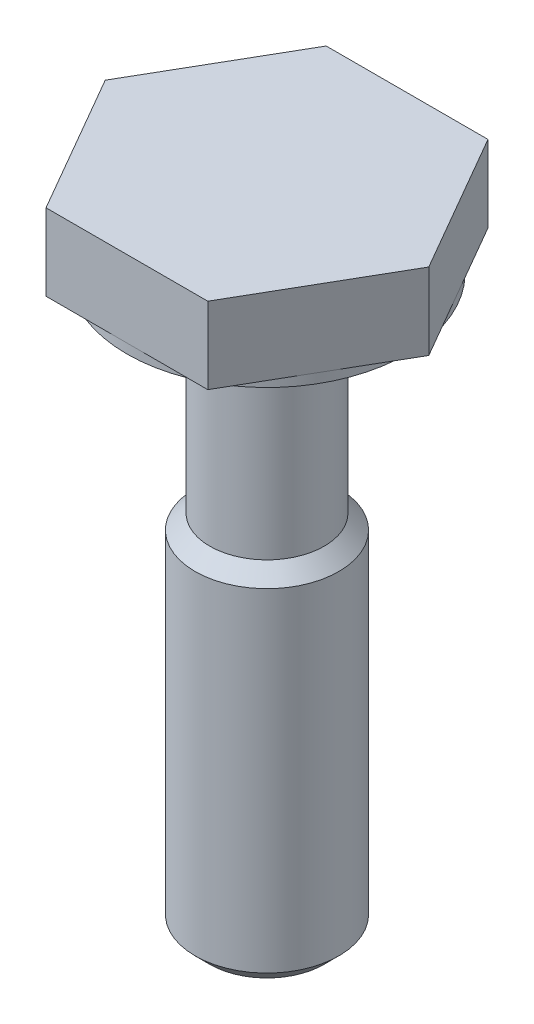
ISO-10303-21;
HEADER;
FILE_DESCRIPTION(('STEP AP214'),'2;1');
FILE_NAME('part.step','',(''),(''),'','','');
FILE_SCHEMA(('AUTOMOTIVE_DESIGN { 1 0 10303 214 1 1 1 1 }'));
ENDSEC;
DATA;
#1=APPLICATION_CONTEXT('core data for automotive mechanical design processes');
#2=APPLICATION_PROTOCOL_DEFINITION('international standard','automotive_design',2000,#1);
#3=PRODUCT_CONTEXT('',#1,'mechanical');
#4=PRODUCT('Part','Part','',(#3));
#5=PRODUCT_RELATED_PRODUCT_CATEGORY('part','',(#4));
#6=PRODUCT_DEFINITION_FORMATION('','',#4);
#7=PRODUCT_DEFINITION_CONTEXT('part definition',#1,'design');
#8=PRODUCT_DEFINITION('design','',#6,#7);
#9=PRODUCT_DEFINITION_SHAPE('','',#8);
#10=(LENGTH_UNIT() NAMED_UNIT(*) SI_UNIT(.MILLI.,.METRE.));
#11=(NAMED_UNIT(*) PLANE_ANGLE_UNIT() SI_UNIT($,.RADIAN.));
#12=(NAMED_UNIT(*) SI_UNIT($,.STERADIAN.) SOLID_ANGLE_UNIT());
#13=UNCERTAINTY_MEASURE_WITH_UNIT(LENGTH_MEASURE(1.E-05),#10,'distance_accuracy_value','');
#14=(GEOMETRIC_REPRESENTATION_CONTEXT(3) GLOBAL_UNCERTAINTY_ASSIGNED_CONTEXT((#13)) GLOBAL_UNIT_ASSIGNED_CONTEXT((#10,
#11,#12)) REPRESENTATION_CONTEXT('',''));
#15=CARTESIAN_POINT('',(0.,0.,0.));
#16=DIRECTION('',(0.,0.,1.));
#17=DIRECTION('',(1.,0.,0.));
#18=AXIS2_PLACEMENT_3D('',#15,#16,#17);
#19=CARTESIAN_POINT('',(0.,0.,0.));
#20=DIRECTION('',(0.,1.,0.));
#21=DIRECTION('',(0.,0.,1.));
#22=AXIS2_PLACEMENT_3D('',#19,#20,#21);
#23=CYLINDRICAL_SURFACE('',#22,1.195);
#24=CARTESIAN_POINT('',(0.,-4.34,0.));
#25=DIRECTION('',(0.,1.,0.));
#26=DIRECTION('',(0.,0.,1.));
#27=AXIS2_PLACEMENT_3D('',#24,#25,#26);
#28=CIRCLE('',#27,1.195);
#29=CARTESIAN_POINT('',(0.,-4.34,1.195));
#30=VERTEX_POINT('',#29);
#31=EDGE_CURVE('E196',#30,#30,#28,.T.);
#32=ORIENTED_EDGE('',*,*,#31,.T.);
#33=EDGE_LOOP('',(#32));
#34=FACE_BOUND('',#33,.T.);
#35=CARTESIAN_POINT('',(0.,0.199999999999999,0.));
#36=DIRECTION('',(0.,1.,0.));
#37=DIRECTION('',(0.,0.,1.));
#38=AXIS2_PLACEMENT_3D('',#35,#36,#37);
#39=CIRCLE('',#38,1.195);
#40=CARTESIAN_POINT('',(0.,0.199999999999999,1.195));
#41=VERTEX_POINT('',#40);
#42=EDGE_CURVE('E40',#41,#41,#39,.F.);
#43=ORIENTED_EDGE('',*,*,#42,.T.);
#44=EDGE_LOOP('',(#43));
#45=FACE_BOUND('',#44,.T.);
#46=ADVANCED_FACE('F36',(#34,#45),#23,.T.);
#47=CARTESIAN_POINT('',(0.,-4.34,0.));
#48=DIRECTION('',(0.,-1.,0.));
#49=DIRECTION('',(0.,0.,-1.));
#50=AXIS2_PLACEMENT_3D('',#47,#48,#49);
#51=CONICAL_SURFACE('',#50,1.195,0.785398163397453);
#52=CARTESIAN_POINT('',(0.,-4.645,0.));
#53=DIRECTION('',(0.,1.,0.));
#54=DIRECTION('',(0.,0.,1.));
#55=AXIS2_PLACEMENT_3D('',#52,#53,#54);
#56=CIRCLE('',#55,1.5);
#57=CARTESIAN_POINT('',(0.,-4.645,1.5));
#58=VERTEX_POINT('',#57);
#59=EDGE_CURVE('E193',#58,#58,#56,.T.);
#60=ORIENTED_EDGE('',*,*,#59,.T.);
#61=EDGE_LOOP('',(#60));
#62=FACE_BOUND('',#61,.T.);
#63=ORIENTED_EDGE('',*,*,#31,.F.);
#64=EDGE_LOOP('',(#63));
#65=FACE_BOUND('',#64,.T.);
#66=ADVANCED_FACE('F222',(#62,#65),#51,.T.);
#67=CARTESIAN_POINT('',(0.,0.,0.));
#68=DIRECTION('',(0.,1.,0.));
#69=DIRECTION('',(0.,0.,1.));
#70=AXIS2_PLACEMENT_3D('',#67,#68,#69);
#71=CYLINDRICAL_SURFACE('',#70,1.5);
#72=CARTESIAN_POINT('',(0.,-11.595,0.));
#73=DIRECTION('',(0.,1.,0.));
#74=DIRECTION('',(0.,0.,1.));
#75=AXIS2_PLACEMENT_3D('',#72,#73,#74);
#76=CIRCLE('',#75,1.5);
#77=CARTESIAN_POINT('',(0.,-11.595,1.5));
#78=VERTEX_POINT('',#77);
#79=EDGE_CURVE('E190',#78,#78,#76,.T.);
#80=ORIENTED_EDGE('',*,*,#79,.T.);
#81=EDGE_LOOP('',(#80));
#82=FACE_BOUND('',#81,.T.);
#83=ORIENTED_EDGE('',*,*,#59,.F.);
#84=EDGE_LOOP('',(#83));
#85=FACE_BOUND('',#84,.T.);
#86=ADVANCED_FACE('F228',(#82,#85),#71,.T.);
#87=CARTESIAN_POINT('',(0.,-11.595,0.));
#88=DIRECTION('',(0.,1.,0.));
#89=DIRECTION('',(0.,0.,1.));
#90=AXIS2_PLACEMENT_3D('',#87,#88,#89);
#91=CONICAL_SURFACE('',#90,1.5,0.785398163397445);
#92=CARTESIAN_POINT('',(0.,-11.9,0.));
#93=DIRECTION('',(0.,1.,0.));
#94=DIRECTION('',(0.,0.,1.));
#95=AXIS2_PLACEMENT_3D('',#92,#93,#94);
#96=CIRCLE('',#95,1.195);
#97=CARTESIAN_POINT('',(0.,-11.9,1.195));
#98=VERTEX_POINT('',#97);
#99=EDGE_CURVE('E187',#98,#98,#96,.T.);
#100=ORIENTED_EDGE('',*,*,#99,.T.);
#101=EDGE_LOOP('',(#100));
#102=FACE_BOUND('',#101,.T.);
#103=ORIENTED_EDGE('',*,*,#79,.F.);
#104=EDGE_LOOP('',(#103));
#105=FACE_BOUND('',#104,.T.);
#106=ADVANCED_FACE('F296',(#102,#105),#91,.T.);
#107=CARTESIAN_POINT('',(-1.195,-11.9,0.));
#108=DIRECTION('',(0.,-1.,0.));
#109=DIRECTION('',(0.,0.,-1.));
#110=AXIS2_PLACEMENT_3D('',#107,#108,#109);
#111=PLANE('',#110);
#112=CARTESIAN_POINT('',(0.,-11.9,0.));
#113=DIRECTION('',(0.,1.,0.));
#114=DIRECTION('',(0.,0.,1.));
#115=AXIS2_PLACEMENT_3D('',#112,#113,#114);
#116=CIRCLE('',#115,0.649999999999999);
#117=CARTESIAN_POINT('',(0.,-11.9,0.649999999999999));
#118=VERTEX_POINT('',#117);
#119=EDGE_CURVE('E184',#118,#118,#116,.T.);
#120=ORIENTED_EDGE('',*,*,#119,.T.);
#121=EDGE_LOOP('',(#120));
#122=FACE_BOUND('',#121,.T.);
#123=ORIENTED_EDGE('',*,*,#99,.F.);
#124=EDGE_LOOP('',(#123));
#125=FACE_BOUND('',#124,.T.);
#126=ADVANCED_FACE('F293',(#122,#125),#111,.T.);
#127=CARTESIAN_POINT('',(0.,-11.9,0.));
#128=DIRECTION('',(0.,-1.,0.));
#129=DIRECTION('',(0.,0.,-1.));
#130=AXIS2_PLACEMENT_3D('',#127,#128,#129);
#131=CONICAL_SURFACE('',#130,0.649999999999999,0.777764723879954);
#132=CARTESIAN_POINT('',(0.,-11.24,0.));
#133=VERTEX_POINT('',#132);
#134=VERTEX_LOOP('',#133);
#135=FACE_BOUND('',#134,.T.);
#136=ORIENTED_EDGE('',*,*,#119,.F.);
#137=EDGE_LOOP('',(#136));
#138=FACE_BOUND('',#137,.T.);
#139=ADVANCED_FACE('F215',(#135,#138),#131,.F.);
#140=CARTESIAN_POINT('',(0.,0.199999999999999,0.));
#141=DIRECTION('',(0.,1.,0.));
#142=DIRECTION('',(0.,0.,1.));
#143=AXIS2_PLACEMENT_3D('',#140,#141,#142);
#144=PLANE('',#143);
#145=CARTESIAN_POINT('',(0.,0.199999999999999,0.));
#146=DIRECTION('',(0.,1.,0.));
#147=DIRECTION('',(0.,0.,1.));
#148=AXIS2_PLACEMENT_3D('',#145,#146,#147);
#149=CIRCLE('',#148,2.5);
#150=CARTESIAN_POINT('',(0.,0.199999999999999,2.5));
#151=VERTEX_POINT('',#150);
#152=EDGE_CURVE('E176',#151,#151,#149,.T.);
#153=ORIENTED_EDGE('',*,*,#152,.F.);
#154=EDGE_LOOP('',(#153));
#155=FACE_BOUND('',#154,.T.);
#156=ORIENTED_EDGE('',*,*,#42,.F.);
#157=EDGE_LOOP('',(#156));
#158=FACE_BOUND('',#157,.T.);
#159=ADVANCED_FACE('F212',(#155,#158),#144,.F.);
#160=CARTESIAN_POINT('',(0.,0.,0.));
#161=DIRECTION('',(0.,1.,0.));
#162=DIRECTION('',(0.,0.,1.));
#163=AXIS2_PLACEMENT_3D('',#160,#161,#162);
#164=CYLINDRICAL_SURFACE('',#163,2.925);
#165=CARTESIAN_POINT('',(0.,0.,0.));
#166=DIRECTION('',(0.,1.,0.));
#167=DIRECTION('',(0.,0.,1.));
#168=AXIS2_PLACEMENT_3D('',#165,#166,#167);
#169=CIRCLE('',#168,2.925);
#170=CARTESIAN_POINT('',(0.,0.,2.925));
#171=VERTEX_POINT('',#170);
#172=EDGE_CURVE('E11',#171,#171,#169,.T.);
#173=ORIENTED_EDGE('',*,*,#172,.T.);
#174=EDGE_LOOP('',(#173));
#175=FACE_BOUND('',#174,.T.);
#176=CARTESIAN_POINT('',(0.,0.199999999999999,0.));
#177=DIRECTION('',(0.,1.,0.));
#178=DIRECTION('',(0.,0.,1.));
#179=AXIS2_PLACEMENT_3D('',#176,#177,#178);
#180=CIRCLE('',#179,2.925);
#181=CARTESIAN_POINT('',(2.53312430606948,0.199999999999999,1.4625));
#182=VERTEX_POINT('',#181);
#183=CARTESIAN_POINT('',(0.,0.199999999999999,2.925));
#184=VERTEX_POINT('',#183);
#185=EDGE_CURVE('E179',#182,#184,#180,.F.);
#186=ORIENTED_EDGE('',*,*,#185,.T.);
#187=CARTESIAN_POINT('',(-2.53312430606948,0.199999999999999,1.4625));
#188=VERTEX_POINT('',#187);
#189=EDGE_CURVE('E183',#184,#188,#180,.F.);
#190=ORIENTED_EDGE('',*,*,#189,.T.);
#191=CARTESIAN_POINT('',(-2.53312430606948,0.199999999999999,-1.4625));
#192=VERTEX_POINT('',#191);
#193=EDGE_CURVE('E266',#188,#192,#180,.F.);
#194=ORIENTED_EDGE('',*,*,#193,.T.);
#195=CARTESIAN_POINT('',(0.,0.199999999999999,-2.925));
#196=VERTEX_POINT('',#195);
#197=EDGE_CURVE('E267',#192,#196,#180,.F.);
#198=ORIENTED_EDGE('',*,*,#197,.T.);
#199=CARTESIAN_POINT('',(2.53312430606948,0.199999999999999,-1.4625));
#200=VERTEX_POINT('',#199);
#201=EDGE_CURVE('E135',#196,#200,#180,.F.);
#202=ORIENTED_EDGE('',*,*,#201,.T.);
#203=EDGE_CURVE('E182',#200,#182,#180,.F.);
#204=ORIENTED_EDGE('',*,*,#203,.T.);
#205=EDGE_LOOP('',(#186,#190,#194,#198,#202,#204));
#206=FACE_BOUND('',#205,.T.);
#207=ADVANCED_FACE('F38',(#175,#206),#164,.T.);
#208=CARTESIAN_POINT('',(-2.925,0.,0.));
#209=DIRECTION('',(0.,-1.,0.));
#210=DIRECTION('',(0.,0.,-1.));
#211=AXIS2_PLACEMENT_3D('',#208,#209,#210);
#212=PLANE('',#211);
#213=CARTESIAN_POINT('',(0.,0.,0.));
#214=DIRECTION('',(0.,1.,0.));
#215=DIRECTION('',(0.,0.,1.));
#216=AXIS2_PLACEMENT_3D('',#213,#214,#215);
#217=CIRCLE('',#216,2.5);
#218=CARTESIAN_POINT('',(0.,0.,2.5));
#219=VERTEX_POINT('',#218);
#220=EDGE_CURVE('E45',#219,#219,#217,.T.);
#221=ORIENTED_EDGE('',*,*,#220,.T.);
#222=EDGE_LOOP('',(#221));
#223=FACE_BOUND('',#222,.T.);
#224=ORIENTED_EDGE('',*,*,#172,.F.);
#225=EDGE_LOOP('',(#224));
#226=FACE_BOUND('',#225,.T.);
#227=ADVANCED_FACE('F202',(#223,#226),#212,.T.);
#228=CARTESIAN_POINT('',(0.,0.,0.));
#229=DIRECTION('',(0.,1.,0.));
#230=DIRECTION('',(0.,0.,1.));
#231=AXIS2_PLACEMENT_3D('',#228,#229,#230);
#232=CYLINDRICAL_SURFACE('',#231,2.5);
#233=ORIENTED_EDGE('',*,*,#220,.F.);
#234=EDGE_LOOP('',(#233));
#235=FACE_BOUND('',#234,.T.);
#236=ORIENTED_EDGE('',*,*,#152,.T.);
#237=EDGE_LOOP('',(#236));
#238=FACE_BOUND('',#237,.T.);
#239=ADVANCED_FACE('F205',(#235,#238),#232,.F.);
#240=ORIENTED_EDGE('',*,*,#189,.F.);
#241=DIRECTION('',(1.,0.,0.));
#242=VECTOR('',#241,1.);
#243=CARTESIAN_POINT('',(-1.68874953737965,0.199999999999999,2.925));
#244=LINE('',#243,#242);
#245=CARTESIAN_POINT('',(-1.68874953737965,0.199999999999999,2.925));
#246=VERTEX_POINT('',#245);
#247=EDGE_CURVE('E52',#246,#184,#244,.T.);
#248=ORIENTED_EDGE('',*,*,#247,.F.);
#249=DIRECTION('',(0.5,0.,0.866025403784439));
#250=VECTOR('',#249,1.);
#251=CARTESIAN_POINT('',(-3.37749907475931,0.199999999999999,0.));
#252=LINE('',#251,#250);
#253=EDGE_CURVE('E144',#188,#246,#252,.T.);
#254=ORIENTED_EDGE('',*,*,#253,.F.);
#255=EDGE_LOOP('',(#240,#248,#254));
#256=FACE_BOUND('',#255,.T.);
#257=ADVANCED_FACE('F208',(#256),#144,.F.);
#258=ORIENTED_EDGE('',*,*,#193,.F.);
#259=CARTESIAN_POINT('',(-3.37749907475931,0.199999999999999,0.));
#260=VERTEX_POINT('',#259);
#261=EDGE_CURVE('E145',#260,#188,#252,.T.);
#262=ORIENTED_EDGE('',*,*,#261,.F.);
#263=DIRECTION('',(-0.5,0.,0.866025403784439));
#264=VECTOR('',#263,1.);
#265=CARTESIAN_POINT('',(-1.68874953737966,0.199999999999999,-2.925));
#266=LINE('',#265,#264);
#267=EDGE_CURVE('E137',#192,#260,#266,.T.);
#268=ORIENTED_EDGE('',*,*,#267,.F.);
#269=EDGE_LOOP('',(#258,#262,#268));
#270=FACE_BOUND('',#269,.T.);
#271=ADVANCED_FACE('F273',(#270),#144,.F.);
#272=ORIENTED_EDGE('',*,*,#197,.F.);
#273=CARTESIAN_POINT('',(-1.68874953737966,0.199999999999999,-2.925));
#274=VERTEX_POINT('',#273);
#275=EDGE_CURVE('E140',#274,#192,#266,.T.);
#276=ORIENTED_EDGE('',*,*,#275,.F.);
#277=DIRECTION('',(-1.,0.,0.));
#278=VECTOR('',#277,1.);
#279=CARTESIAN_POINT('',(1.68874953737965,0.199999999999999,-2.925));
#280=LINE('',#279,#278);
#281=EDGE_CURVE('E138',#196,#274,#280,.T.);
#282=ORIENTED_EDGE('',*,*,#281,.F.);
#283=EDGE_LOOP('',(#272,#276,#282));
#284=FACE_BOUND('',#283,.T.);
#285=ADVANCED_FACE('F271',(#284),#144,.F.);
#286=ORIENTED_EDGE('',*,*,#201,.F.);
#287=CARTESIAN_POINT('',(1.68874953737965,0.199999999999999,-2.925));
#288=VERTEX_POINT('',#287);
#289=EDGE_CURVE('E126',#288,#196,#280,.T.);
#290=ORIENTED_EDGE('',*,*,#289,.F.);
#291=DIRECTION('',(-0.5,0.,-0.866025403784439));
#292=VECTOR('',#291,1.);
#293=CARTESIAN_POINT('',(3.37749907475931,0.199999999999999,0.));
#294=LINE('',#293,#292);
#295=EDGE_CURVE('E109',#200,#288,#294,.T.);
#296=ORIENTED_EDGE('',*,*,#295,.F.);
#297=EDGE_LOOP('',(#286,#290,#296));
#298=FACE_BOUND('',#297,.T.);
#299=ADVANCED_FACE('F134',(#298),#144,.F.);
#300=ORIENTED_EDGE('',*,*,#203,.F.);
#301=CARTESIAN_POINT('',(3.37749907475931,0.199999999999999,0.));
#302=VERTEX_POINT('',#301);
#303=EDGE_CURVE('E117',#302,#200,#294,.T.);
#304=ORIENTED_EDGE('',*,*,#303,.F.);
#305=DIRECTION('',(0.5,0.,-0.866025403784439));
#306=VECTOR('',#305,1.);
#307=CARTESIAN_POINT('',(1.68874953737966,0.199999999999999,2.925));
#308=LINE('',#307,#306);
#309=EDGE_CURVE('E150',#182,#302,#308,.T.);
#310=ORIENTED_EDGE('',*,*,#309,.F.);
#311=EDGE_LOOP('',(#300,#304,#310));
#312=FACE_BOUND('',#311,.T.);
#313=ADVANCED_FACE('F249',(#312),#144,.F.);
#314=ORIENTED_EDGE('',*,*,#185,.F.);
#315=CARTESIAN_POINT('',(1.68874953737966,0.199999999999999,2.925));
#316=VERTEX_POINT('',#315);
#317=EDGE_CURVE('E132',#316,#182,#308,.T.);
#318=ORIENTED_EDGE('',*,*,#317,.F.);
#319=EDGE_CURVE('E148',#184,#316,#244,.T.);
#320=ORIENTED_EDGE('',*,*,#319,.F.);
#321=EDGE_LOOP('',(#314,#318,#320));
#322=FACE_BOUND('',#321,.T.);
#323=ADVANCED_FACE('F217',(#322),#144,.F.);
#324=CARTESIAN_POINT('',(3.37749907475931,0.199999999999999,0.));
#325=DIRECTION('',(0.866025403784438,0.,-0.5));
#326=DIRECTION('',(-0.5,0.,-0.866025403784439));
#327=AXIS2_PLACEMENT_3D('',#324,#325,#326);
#328=PLANE('',#327);
#329=ORIENTED_EDGE('',*,*,#303,.T.);
#330=ORIENTED_EDGE('',*,*,#295,.T.);
#331=DIRECTION('',(0.,1.,0.));
#332=VECTOR('',#331,1.);
#333=CARTESIAN_POINT('',(1.68874953737965,0.199999999999999,-2.925));
#334=LINE('',#333,#332);
#335=CARTESIAN_POINT('',(1.68874953737965,1.8,-2.925));
#336=VERTEX_POINT('',#335);
#337=EDGE_CURVE('E113',#288,#336,#334,.T.);
#338=ORIENTED_EDGE('',*,*,#337,.T.);
#339=DIRECTION('',(-0.5,0.,-0.866025403784439));
#340=VECTOR('',#339,1.);
#341=CARTESIAN_POINT('',(3.37749907475931,1.8,0.));
#342=LINE('',#341,#340);
#343=CARTESIAN_POINT('',(3.37749907475931,1.8,0.));
#344=VERTEX_POINT('',#343);
#345=EDGE_CURVE('E153',#344,#336,#342,.T.);
#346=ORIENTED_EDGE('',*,*,#345,.F.);
#347=DIRECTION('',(0.,1.,0.));
#348=VECTOR('',#347,1.);
#349=CARTESIAN_POINT('',(3.37749907475931,0.199999999999999,0.));
#350=LINE('',#349,#348);
#351=EDGE_CURVE('E167',#302,#344,#350,.T.);
#352=ORIENTED_EDGE('',*,*,#351,.F.);
#353=EDGE_LOOP('',(#329,#330,#338,#346,#352));
#354=FACE_BOUND('',#353,.T.);
#355=ADVANCED_FACE('F111',(#354),#328,.T.);
#356=CARTESIAN_POINT('',(1.68874953737966,0.199999999999999,2.925));
#357=DIRECTION('',(0.866025403784439,0.,0.5));
#358=DIRECTION('',(0.5,0.,-0.866025403784439));
#359=AXIS2_PLACEMENT_3D('',#356,#357,#358);
#360=PLANE('',#359);
#361=ORIENTED_EDGE('',*,*,#317,.T.);
#362=ORIENTED_EDGE('',*,*,#309,.T.);
#363=ORIENTED_EDGE('',*,*,#351,.T.);
#364=DIRECTION('',(0.5,0.,-0.866025403784439));
#365=VECTOR('',#364,1.);
#366=CARTESIAN_POINT('',(1.68874953737966,1.8,2.925));
#367=LINE('',#366,#365);
#368=CARTESIAN_POINT('',(1.68874953737966,1.8,2.925));
#369=VERTEX_POINT('',#368);
#370=EDGE_CURVE('E121',#369,#344,#367,.T.);
#371=ORIENTED_EDGE('',*,*,#370,.F.);
#372=DIRECTION('',(0.,1.,0.));
#373=VECTOR('',#372,1.);
#374=CARTESIAN_POINT('',(1.68874953737966,0.199999999999999,2.925));
#375=LINE('',#374,#373);
#376=EDGE_CURVE('E169',#316,#369,#375,.T.);
#377=ORIENTED_EDGE('',*,*,#376,.F.);
#378=EDGE_LOOP('',(#361,#362,#363,#371,#377));
#379=FACE_BOUND('',#378,.T.);
#380=ADVANCED_FACE('F252',(#379),#360,.T.);
#381=CARTESIAN_POINT('',(-1.68874953737965,0.199999999999999,2.925));
#382=DIRECTION('',(0.,0.,1.));
#383=DIRECTION('',(1.,0.,0.));
#384=AXIS2_PLACEMENT_3D('',#381,#382,#383);
#385=PLANE('',#384);
#386=ORIENTED_EDGE('',*,*,#247,.T.);
#387=ORIENTED_EDGE('',*,*,#319,.T.);
#388=ORIENTED_EDGE('',*,*,#376,.T.);
#389=DIRECTION('',(1.,0.,0.));
#390=VECTOR('',#389,1.);
#391=CARTESIAN_POINT('',(-1.68874953737965,1.8,2.925));
#392=LINE('',#391,#390);
#393=CARTESIAN_POINT('',(-1.68874953737965,1.8,2.925));
#394=VERTEX_POINT('',#393);
#395=EDGE_CURVE('E162',#394,#369,#392,.T.);
#396=ORIENTED_EDGE('',*,*,#395,.F.);
#397=DIRECTION('',(0.,1.,0.));
#398=VECTOR('',#397,1.);
#399=CARTESIAN_POINT('',(-1.68874953737965,0.199999999999999,2.925));
#400=LINE('',#399,#398);
#401=EDGE_CURVE('E171',#246,#394,#400,.T.);
#402=ORIENTED_EDGE('',*,*,#401,.F.);
#403=EDGE_LOOP('',(#386,#387,#388,#396,#402));
#404=FACE_BOUND('',#403,.T.);
#405=ADVANCED_FACE('F255',(#404),#385,.T.);
#406=CARTESIAN_POINT('',(-3.37749907475931,0.199999999999999,0.));
#407=DIRECTION('',(-0.866025403784438,0.,0.5));
#408=DIRECTION('',(0.5,0.,0.866025403784438));
#409=AXIS2_PLACEMENT_3D('',#406,#407,#408);
#410=PLANE('',#409);
#411=ORIENTED_EDGE('',*,*,#261,.T.);
#412=ORIENTED_EDGE('',*,*,#253,.T.);
#413=ORIENTED_EDGE('',*,*,#401,.T.);
#414=DIRECTION('',(0.5,0.,0.866025403784439));
#415=VECTOR('',#414,1.);
#416=CARTESIAN_POINT('',(-3.37749907475931,1.8,0.));
#417=LINE('',#416,#415);
#418=CARTESIAN_POINT('',(-3.37749907475931,1.8,0.));
#419=VERTEX_POINT('',#418);
#420=EDGE_CURVE('E159',#419,#394,#417,.T.);
#421=ORIENTED_EDGE('',*,*,#420,.F.);
#422=DIRECTION('',(0.,1.,0.));
#423=VECTOR('',#422,1.);
#424=CARTESIAN_POINT('',(-3.37749907475931,0.199999999999999,0.));
#425=LINE('',#424,#423);
#426=EDGE_CURVE('E173',#260,#419,#425,.T.);
#427=ORIENTED_EDGE('',*,*,#426,.F.);
#428=EDGE_LOOP('',(#411,#412,#413,#421,#427));
#429=FACE_BOUND('',#428,.T.);
#430=ADVANCED_FACE('F262',(#429),#410,.T.);
#431=CARTESIAN_POINT('',(-1.68874953737966,0.199999999999999,-2.925));
#432=DIRECTION('',(-0.866025403784439,0.,-0.499999999999999));
#433=DIRECTION('',(-0.5,0.,0.866025403784439));
#434=AXIS2_PLACEMENT_3D('',#431,#432,#433);
#435=PLANE('',#434);
#436=ORIENTED_EDGE('',*,*,#275,.T.);
#437=ORIENTED_EDGE('',*,*,#267,.T.);
#438=ORIENTED_EDGE('',*,*,#426,.T.);
#439=DIRECTION('',(-0.5,0.,0.866025403784439));
#440=VECTOR('',#439,1.);
#441=CARTESIAN_POINT('',(-1.68874953737966,1.8,-2.925));
#442=LINE('',#441,#440);
#443=CARTESIAN_POINT('',(-1.68874953737966,1.8,-2.925));
#444=VERTEX_POINT('',#443);
#445=EDGE_CURVE('E156',#444,#419,#442,.T.);
#446=ORIENTED_EDGE('',*,*,#445,.F.);
#447=DIRECTION('',(0.,1.,0.));
#448=VECTOR('',#447,1.);
#449=CARTESIAN_POINT('',(-1.68874953737966,0.199999999999999,-2.925));
#450=LINE('',#449,#448);
#451=EDGE_CURVE('E131',#274,#444,#450,.T.);
#452=ORIENTED_EDGE('',*,*,#451,.F.);
#453=EDGE_LOOP('',(#436,#437,#438,#446,#452));
#454=FACE_BOUND('',#453,.T.);
#455=ADVANCED_FACE('F276',(#454),#435,.T.);
#456=CARTESIAN_POINT('',(1.68874953737965,0.199999999999999,-2.925));
#457=DIRECTION('',(0.,0.,-1.));
#458=DIRECTION('',(-1.,0.,0.));
#459=AXIS2_PLACEMENT_3D('',#456,#457,#458);
#460=PLANE('',#459);
#461=ORIENTED_EDGE('',*,*,#289,.T.);
#462=ORIENTED_EDGE('',*,*,#281,.T.);
#463=ORIENTED_EDGE('',*,*,#451,.T.);
#464=DIRECTION('',(-1.,0.,0.));
#465=VECTOR('',#464,1.);
#466=CARTESIAN_POINT('',(1.68874953737965,1.8,-2.925));
#467=LINE('',#466,#465);
#468=EDGE_CURVE('E129',#336,#444,#467,.T.);
#469=ORIENTED_EDGE('',*,*,#468,.F.);
#470=ORIENTED_EDGE('',*,*,#337,.F.);
#471=EDGE_LOOP('',(#461,#462,#463,#469,#470));
#472=FACE_BOUND('',#471,.T.);
#473=ADVANCED_FACE('F125',(#472),#460,.T.);
#474=CARTESIAN_POINT('',(-2.875,1.8,0.));
#475=DIRECTION('',(0.,1.,0.));
#476=DIRECTION('',(0.,0.,1.));
#477=AXIS2_PLACEMENT_3D('',#474,#475,#476);
#478=PLANE('',#477);
#479=ORIENTED_EDGE('',*,*,#345,.T.);
#480=ORIENTED_EDGE('',*,*,#468,.T.);
#481=ORIENTED_EDGE('',*,*,#445,.T.);
#482=ORIENTED_EDGE('',*,*,#420,.T.);
#483=ORIENTED_EDGE('',*,*,#395,.T.);
#484=ORIENTED_EDGE('',*,*,#370,.T.);
#485=EDGE_LOOP('',(#479,#480,#481,#482,#483,#484));
#486=FACE_BOUND('',#485,.T.);
#487=ADVANCED_FACE('F257',(#486),#478,.T.);
#488=CLOSED_SHELL('',(#46,#66,#86,#106,#126,#139,#159,#207,#227,#239,#257,#271,#285,#299,#313,
#323,#355,#380,#405,#430,#455,#473,#487));
#489=MANIFOLD_SOLID_BREP('B2',#488);
#490=ADVANCED_BREP_SHAPE_REPRESENTATION('',(#18,#489),#14);
#491=SHAPE_DEFINITION_REPRESENTATION(#9,#490);
ENDSEC;
END-ISO-10303-21;
